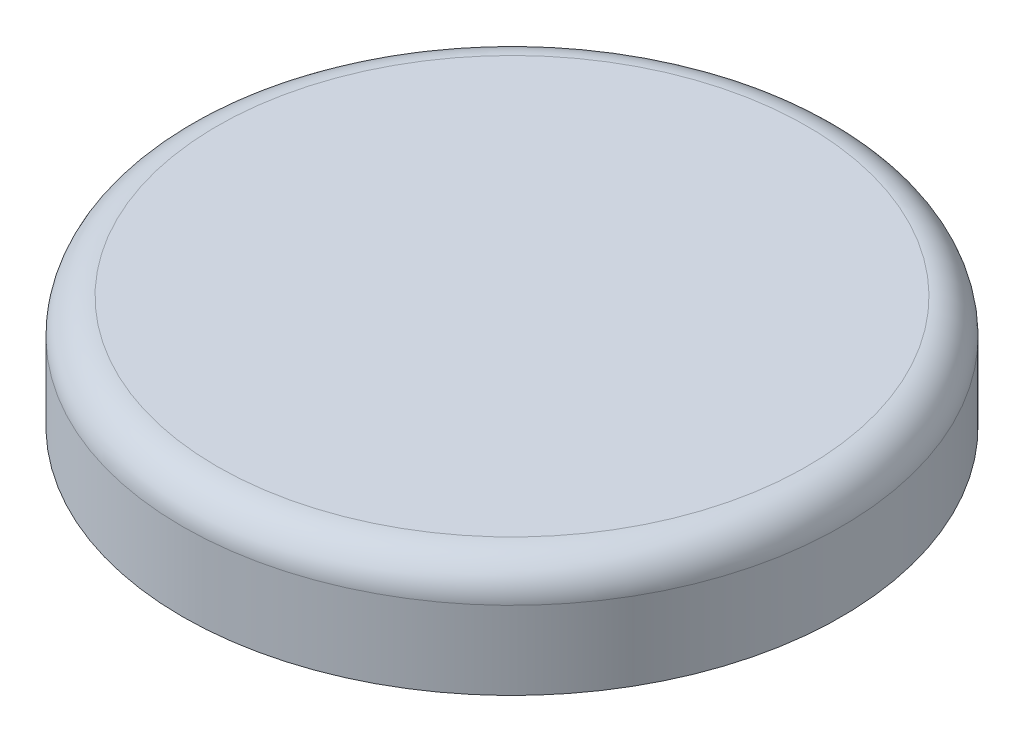
ISO-10303-21;
HEADER;
FILE_DESCRIPTION(('STEP AP214'),'2;1');
FILE_NAME('part.step','',(''),(''),'','','');
FILE_SCHEMA(('AUTOMOTIVE_DESIGN { 1 0 10303 214 1 1 1 1 }'));
ENDSEC;
DATA;
#1=APPLICATION_CONTEXT('core data for automotive mechanical design processes');
#2=APPLICATION_PROTOCOL_DEFINITION('international standard','automotive_design',2000,#1);
#3=PRODUCT_CONTEXT('',#1,'mechanical');
#4=PRODUCT('Part','Part','',(#3));
#5=PRODUCT_RELATED_PRODUCT_CATEGORY('part','',(#4));
#6=PRODUCT_DEFINITION_FORMATION('','',#4);
#7=PRODUCT_DEFINITION_CONTEXT('part definition',#1,'design');
#8=PRODUCT_DEFINITION('design','',#6,#7);
#9=PRODUCT_DEFINITION_SHAPE('','',#8);
#10=(LENGTH_UNIT() NAMED_UNIT(*) SI_UNIT(.MILLI.,.METRE.));
#11=(NAMED_UNIT(*) PLANE_ANGLE_UNIT() SI_UNIT($,.RADIAN.));
#12=(NAMED_UNIT(*) SI_UNIT($,.STERADIAN.) SOLID_ANGLE_UNIT());
#13=UNCERTAINTY_MEASURE_WITH_UNIT(LENGTH_MEASURE(1.E-05),#10,'distance_accuracy_value','');
#14=(GEOMETRIC_REPRESENTATION_CONTEXT(3) GLOBAL_UNCERTAINTY_ASSIGNED_CONTEXT((#13)) GLOBAL_UNIT_ASSIGNED_CONTEXT((#10,
#11,#12)) REPRESENTATION_CONTEXT('',''));
#15=CARTESIAN_POINT('',(0.,0.,0.));
#16=DIRECTION('',(0.,0.,1.));
#17=DIRECTION('',(1.,0.,0.));
#18=AXIS2_PLACEMENT_3D('',#15,#16,#17);
#19=CARTESIAN_POINT('',(0.,2.6,0.));
#20=DIRECTION('',(0.,-1.,0.));
#21=DIRECTION('',(0.,0.,-1.));
#22=AXIS2_PLACEMENT_3D('',#19,#20,#21);
#23=CYLINDRICAL_SURFACE('',#22,7.6);
#24=CARTESIAN_POINT('',(0.,1.8,0.));
#25=DIRECTION('',(0.,1.,0.));
#26=DIRECTION('',(0.,0.,1.));
#27=AXIS2_PLACEMENT_3D('',#24,#25,#26);
#28=CIRCLE('',#27,7.6);
#29=CARTESIAN_POINT('',(0.,1.8,7.6));
#30=VERTEX_POINT('',#29);
#31=EDGE_CURVE('E10',#30,#30,#28,.F.);
#32=ORIENTED_EDGE('',*,*,#31,.T.);
#33=EDGE_LOOP('',(#32));
#34=FACE_BOUND('',#33,.T.);
#35=CARTESIAN_POINT('',(0.,0.,0.));
#36=DIRECTION('',(0.,1.,0.));
#37=DIRECTION('',(0.,0.,1.));
#38=AXIS2_PLACEMENT_3D('',#35,#36,#37);
#39=CIRCLE('',#38,7.6);
#40=CARTESIAN_POINT('',(0.,0.,7.6));
#41=VERTEX_POINT('',#40);
#42=EDGE_CURVE('E41',#41,#41,#39,.T.);
#43=ORIENTED_EDGE('',*,*,#42,.T.);
#44=EDGE_LOOP('',(#43));
#45=FACE_BOUND('',#44,.T.);
#46=ADVANCED_FACE('F30',(#34,#45),#23,.T.);
#47=CARTESIAN_POINT('',(0.,2.6,0.));
#48=DIRECTION('',(0.,1.,0.));
#49=DIRECTION('',(0.,0.,1.));
#50=AXIS2_PLACEMENT_3D('',#47,#48,#49);
#51=PLANE('',#50);
#52=CARTESIAN_POINT('',(0.,2.6,0.));
#53=DIRECTION('',(0.,1.,0.));
#54=DIRECTION('',(0.,0.,1.));
#55=AXIS2_PLACEMENT_3D('',#52,#53,#54);
#56=CIRCLE('',#55,6.8);
#57=CARTESIAN_POINT('',(0.,2.6,6.8));
#58=VERTEX_POINT('',#57);
#59=EDGE_CURVE('E37',#58,#58,#56,.T.);
#60=ORIENTED_EDGE('',*,*,#59,.T.);
#61=EDGE_LOOP('',(#60));
#62=FACE_BOUND('',#61,.T.);
#63=ADVANCED_FACE('F51',(#62),#51,.T.);
#64=CARTESIAN_POINT('',(0.,0.,0.));
#65=DIRECTION('',(0.,1.,0.));
#66=DIRECTION('',(0.,0.,1.));
#67=AXIS2_PLACEMENT_3D('',#64,#65,#66);
#68=PLANE('',#67);
#69=ORIENTED_EDGE('',*,*,#42,.F.);
#70=EDGE_LOOP('',(#69));
#71=FACE_BOUND('',#70,.T.);
#72=ADVANCED_FACE('F49',(#71),#68,.F.);
#73=CARTESIAN_POINT('',(0.,1.8,0.));
#74=DIRECTION('',(0.,1.,0.));
#75=DIRECTION('',(0.,0.,1.));
#76=AXIS2_PLACEMENT_3D('',#73,#74,#75);
#77=TOROIDAL_SURFACE('',#76,6.8,0.8);
#78=ORIENTED_EDGE('',*,*,#31,.F.);
#79=EDGE_LOOP('',(#78));
#80=FACE_BOUND('',#79,.T.);
#81=ORIENTED_EDGE('',*,*,#59,.F.);
#82=EDGE_LOOP('',(#81));
#83=FACE_BOUND('',#82,.T.);
#84=ADVANCED_FACE('F32',(#80,#83),#77,.T.);
#85=CLOSED_SHELL('',(#46,#63,#72,#84));
#86=MANIFOLD_SOLID_BREP('B2',#85);
#87=ADVANCED_BREP_SHAPE_REPRESENTATION('',(#18,#86),#14);
#88=SHAPE_DEFINITION_REPRESENTATION(#9,#87);
ENDSEC;
END-ISO-10303-21;
